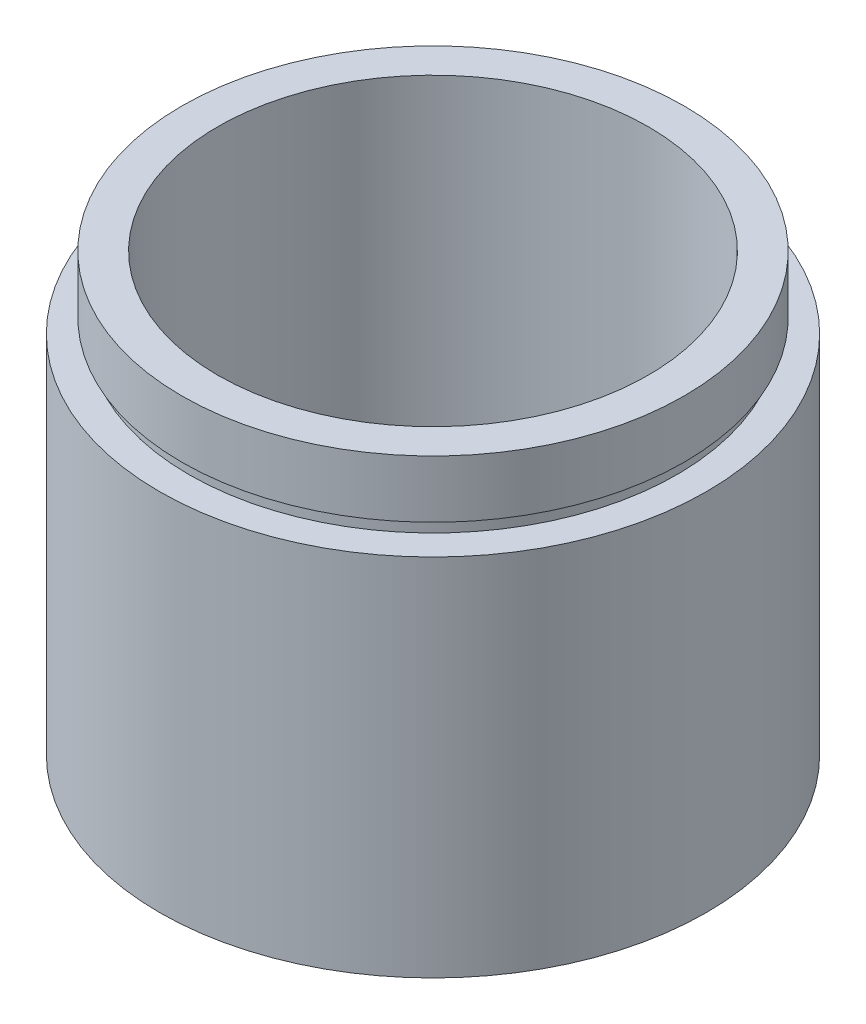
ISO-10303-21;
HEADER;
FILE_DESCRIPTION(('STEP AP214'),'2;1');
FILE_NAME('part.step','',(''),(''),'','','');
FILE_SCHEMA(('AUTOMOTIVE_DESIGN { 1 0 10303 214 1 1 1 1 }'));
ENDSEC;
DATA;
#1=APPLICATION_CONTEXT('core data for automotive mechanical design processes');
#2=APPLICATION_PROTOCOL_DEFINITION('international standard','automotive_design',2000,#1);
#3=PRODUCT_CONTEXT('',#1,'mechanical');
#4=PRODUCT('Part','Part','',(#3));
#5=PRODUCT_RELATED_PRODUCT_CATEGORY('part','',(#4));
#6=PRODUCT_DEFINITION_FORMATION('','',#4);
#7=PRODUCT_DEFINITION_CONTEXT('part definition',#1,'design');
#8=PRODUCT_DEFINITION('design','',#6,#7);
#9=PRODUCT_DEFINITION_SHAPE('','',#8);
#10=(LENGTH_UNIT() NAMED_UNIT(*) SI_UNIT(.MILLI.,.METRE.));
#11=(NAMED_UNIT(*) PLANE_ANGLE_UNIT() SI_UNIT($,.RADIAN.));
#12=(NAMED_UNIT(*) SI_UNIT($,.STERADIAN.) SOLID_ANGLE_UNIT());
#13=UNCERTAINTY_MEASURE_WITH_UNIT(LENGTH_MEASURE(1.E-05),#10,'distance_accuracy_value','');
#14=(GEOMETRIC_REPRESENTATION_CONTEXT(3) GLOBAL_UNCERTAINTY_ASSIGNED_CONTEXT((#13)) GLOBAL_UNIT_ASSIGNED_CONTEXT((#10,
#11,#12)) REPRESENTATION_CONTEXT('',''));
#15=CARTESIAN_POINT('',(0.,0.,0.));
#16=DIRECTION('',(0.,0.,1.));
#17=DIRECTION('',(1.,0.,0.));
#18=AXIS2_PLACEMENT_3D('',#15,#16,#17);
#19=CARTESIAN_POINT('',(17.,0.,0.));
#20=DIRECTION('',(0.,1.,0.));
#21=DIRECTION('',(0.,0.,1.));
#22=AXIS2_PLACEMENT_3D('',#19,#20,#21);
#23=PLANE('',#22);
#24=CARTESIAN_POINT('',(0.,0.,0.));
#25=DIRECTION('',(0.,1.,0.));
#26=DIRECTION('',(0.,0.,1.));
#27=AXIS2_PLACEMENT_3D('',#24,#25,#26);
#28=CIRCLE('',#27,19.05);
#29=CARTESIAN_POINT('',(0.,0.,19.05));
#30=VERTEX_POINT('',#29);
#31=EDGE_CURVE('E10',#30,#30,#28,.T.);
#32=ORIENTED_EDGE('',*,*,#31,.F.);
#33=EDGE_LOOP('',(#32));
#34=FACE_BOUND('',#33,.T.);
#35=CARTESIAN_POINT('',(0.,0.,0.));
#36=DIRECTION('',(0.,1.,0.));
#37=DIRECTION('',(0.,0.,1.));
#38=AXIS2_PLACEMENT_3D('',#35,#36,#37);
#39=CIRCLE('',#38,17.);
#40=CARTESIAN_POINT('',(0.,0.,17.));
#41=VERTEX_POINT('',#40);
#42=EDGE_CURVE('E77',#41,#41,#39,.T.);
#43=ORIENTED_EDGE('',*,*,#42,.T.);
#44=EDGE_LOOP('',(#43));
#45=FACE_BOUND('',#44,.T.);
#46=ADVANCED_FACE('F37',(#34,#45),#23,.F.);
#47=CARTESIAN_POINT('',(0.,161.376166943427,0.));
#48=DIRECTION('',(0.,1.,0.));
#49=DIRECTION('',(0.,0.,1.));
#50=AXIS2_PLACEMENT_3D('',#47,#48,#49);
#51=CYLINDRICAL_SURFACE('',#50,19.05);
#52=CARTESIAN_POINT('',(0.,25.4,0.));
#53=DIRECTION('',(0.,1.,0.));
#54=DIRECTION('',(0.,0.,1.));
#55=AXIS2_PLACEMENT_3D('',#52,#53,#54);
#56=CIRCLE('',#55,19.05);
#57=CARTESIAN_POINT('',(0.,25.4,19.05));
#58=VERTEX_POINT('',#57);
#59=EDGE_CURVE('E43',#58,#58,#56,.T.);
#60=ORIENTED_EDGE('',*,*,#59,.F.);
#61=EDGE_LOOP('',(#60));
#62=FACE_BOUND('',#61,.T.);
#63=ORIENTED_EDGE('',*,*,#31,.T.);
#64=EDGE_LOOP('',(#63));
#65=FACE_BOUND('',#64,.T.);
#66=ADVANCED_FACE('F138',(#62,#65),#51,.T.);
#67=CARTESIAN_POINT('',(19.05,25.4,0.));
#68=DIRECTION('',(0.,-1.,0.));
#69=DIRECTION('',(0.,0.,-1.));
#70=AXIS2_PLACEMENT_3D('',#67,#68,#69);
#71=PLANE('',#70);
#72=CARTESIAN_POINT('',(0.,25.4,0.));
#73=DIRECTION('',(0.,1.,0.));
#74=DIRECTION('',(0.,0.,1.));
#75=AXIS2_PLACEMENT_3D('',#72,#73,#74);
#76=CIRCLE('',#75,17.);
#77=CARTESIAN_POINT('',(0.,25.4,17.));
#78=VERTEX_POINT('',#77);
#79=EDGE_CURVE('E47',#78,#78,#76,.T.);
#80=ORIENTED_EDGE('',*,*,#79,.F.);
#81=EDGE_LOOP('',(#80));
#82=FACE_BOUND('',#81,.T.);
#83=ORIENTED_EDGE('',*,*,#59,.T.);
#84=EDGE_LOOP('',(#83));
#85=FACE_BOUND('',#84,.T.);
#86=ADVANCED_FACE('F133',(#82,#85),#71,.F.);
#87=CARTESIAN_POINT('',(0.,161.376166943427,0.));
#88=DIRECTION('',(0.,1.,0.));
#89=DIRECTION('',(0.,0.,1.));
#90=AXIS2_PLACEMENT_3D('',#87,#88,#89);
#91=CYLINDRICAL_SURFACE('',#90,17.);
#92=CARTESIAN_POINT('',(0.,26.4,0.));
#93=DIRECTION('',(0.,1.,0.));
#94=DIRECTION('',(0.,0.,1.));
#95=AXIS2_PLACEMENT_3D('',#92,#93,#94);
#96=CIRCLE('',#95,17.);
#97=CARTESIAN_POINT('',(0.,26.4,17.));
#98=VERTEX_POINT('',#97);
#99=EDGE_CURVE('E51',#98,#98,#96,.T.);
#100=ORIENTED_EDGE('',*,*,#99,.F.);
#101=EDGE_LOOP('',(#100));
#102=FACE_BOUND('',#101,.T.);
#103=ORIENTED_EDGE('',*,*,#79,.T.);
#104=EDGE_LOOP('',(#103));
#105=FACE_BOUND('',#104,.T.);
#106=ADVANCED_FACE('F127',(#102,#105),#91,.T.);
#107=CARTESIAN_POINT('',(17.,26.4,0.));
#108=DIRECTION('',(0.,1.,0.));
#109=DIRECTION('',(0.,0.,1.));
#110=AXIS2_PLACEMENT_3D('',#107,#108,#109);
#111=PLANE('',#110);
#112=CARTESIAN_POINT('',(0.,26.4,0.));
#113=DIRECTION('',(0.,1.,0.));
#114=DIRECTION('',(0.,0.,1.));
#115=AXIS2_PLACEMENT_3D('',#112,#113,#114);
#116=CIRCLE('',#115,17.5);
#117=CARTESIAN_POINT('',(0.,26.4,17.5));
#118=VERTEX_POINT('',#117);
#119=EDGE_CURVE('E56',#118,#118,#116,.T.);
#120=ORIENTED_EDGE('',*,*,#119,.F.);
#121=EDGE_LOOP('',(#120));
#122=FACE_BOUND('',#121,.T.);
#123=ORIENTED_EDGE('',*,*,#99,.T.);
#124=EDGE_LOOP('',(#123));
#125=FACE_BOUND('',#124,.T.);
#126=ADVANCED_FACE('F121',(#122,#125),#111,.F.);
#127=CARTESIAN_POINT('',(0.,161.376166943427,0.));
#128=DIRECTION('',(0.,1.,0.));
#129=DIRECTION('',(0.,0.,1.));
#130=AXIS2_PLACEMENT_3D('',#127,#128,#129);
#131=CYLINDRICAL_SURFACE('',#130,17.5);
#132=CARTESIAN_POINT('',(0.,30.4,0.));
#133=DIRECTION('',(0.,1.,0.));
#134=DIRECTION('',(0.,0.,1.));
#135=AXIS2_PLACEMENT_3D('',#132,#133,#134);
#136=CIRCLE('',#135,17.5);
#137=CARTESIAN_POINT('',(0.,30.4,17.5));
#138=VERTEX_POINT('',#137);
#139=EDGE_CURVE('E59',#138,#138,#136,.T.);
#140=ORIENTED_EDGE('',*,*,#139,.F.);
#141=EDGE_LOOP('',(#140));
#142=FACE_BOUND('',#141,.T.);
#143=ORIENTED_EDGE('',*,*,#119,.T.);
#144=EDGE_LOOP('',(#143));
#145=FACE_BOUND('',#144,.T.);
#146=ADVANCED_FACE('F115',(#142,#145),#131,.T.);
#147=CARTESIAN_POINT('',(17.5,30.4,0.));
#148=DIRECTION('',(0.,-1.,0.));
#149=DIRECTION('',(0.,0.,-1.));
#150=AXIS2_PLACEMENT_3D('',#147,#148,#149);
#151=PLANE('',#150);
#152=CARTESIAN_POINT('',(0.,30.4,0.));
#153=DIRECTION('',(0.,1.,0.));
#154=DIRECTION('',(0.,0.,1.));
#155=AXIS2_PLACEMENT_3D('',#152,#153,#154);
#156=CIRCLE('',#155,15.);
#157=CARTESIAN_POINT('',(0.,30.4,15.));
#158=VERTEX_POINT('',#157);
#159=EDGE_CURVE('E62',#158,#158,#156,.T.);
#160=ORIENTED_EDGE('',*,*,#159,.F.);
#161=EDGE_LOOP('',(#160));
#162=FACE_BOUND('',#161,.T.);
#163=ORIENTED_EDGE('',*,*,#139,.T.);
#164=EDGE_LOOP('',(#163));
#165=FACE_BOUND('',#164,.T.);
#166=ADVANCED_FACE('F109',(#162,#165),#151,.F.);
#167=CARTESIAN_POINT('',(0.,161.376166943427,0.));
#168=DIRECTION('',(0.,1.,0.));
#169=DIRECTION('',(0.,0.,1.));
#170=AXIS2_PLACEMENT_3D('',#167,#168,#169);
#171=CYLINDRICAL_SURFACE('',#170,15.);
#172=CARTESIAN_POINT('',(0.,5.49999999999998,0.));
#173=DIRECTION('',(0.,1.,0.));
#174=DIRECTION('',(0.,0.,1.));
#175=AXIS2_PLACEMENT_3D('',#172,#173,#174);
#176=CIRCLE('',#175,15.);
#177=CARTESIAN_POINT('',(0.,5.49999999999998,15.));
#178=VERTEX_POINT('',#177);
#179=EDGE_CURVE('E65',#178,#178,#176,.T.);
#180=ORIENTED_EDGE('',*,*,#179,.F.);
#181=EDGE_LOOP('',(#180));
#182=FACE_BOUND('',#181,.T.);
#183=ORIENTED_EDGE('',*,*,#159,.T.);
#184=EDGE_LOOP('',(#183));
#185=FACE_BOUND('',#184,.T.);
#186=ADVANCED_FACE('F103',(#182,#185),#171,.F.);
#187=CARTESIAN_POINT('',(17.6,5.49999999999998,0.));
#188=DIRECTION('',(0.,1.,0.));
#189=DIRECTION('',(0.,0.,1.));
#190=AXIS2_PLACEMENT_3D('',#187,#188,#189);
#191=PLANE('',#190);
#192=CARTESIAN_POINT('',(0.,5.49999999999998,0.));
#193=DIRECTION('',(0.,1.,0.));
#194=DIRECTION('',(0.,0.,1.));
#195=AXIS2_PLACEMENT_3D('',#192,#193,#194);
#196=CIRCLE('',#195,17.6);
#197=CARTESIAN_POINT('',(0.,5.49999999999998,17.6));
#198=VERTEX_POINT('',#197);
#199=EDGE_CURVE('E68',#198,#198,#196,.T.);
#200=ORIENTED_EDGE('',*,*,#199,.F.);
#201=EDGE_LOOP('',(#200));
#202=FACE_BOUND('',#201,.T.);
#203=ORIENTED_EDGE('',*,*,#179,.T.);
#204=EDGE_LOOP('',(#203));
#205=FACE_BOUND('',#204,.T.);
#206=ADVANCED_FACE('F97',(#202,#205),#191,.F.);
#207=CARTESIAN_POINT('',(0.,161.376166943427,0.));
#208=DIRECTION('',(0.,1.,0.));
#209=DIRECTION('',(0.,0.,1.));
#210=AXIS2_PLACEMENT_3D('',#207,#208,#209);
#211=CYLINDRICAL_SURFACE('',#210,17.6);
#212=CARTESIAN_POINT('',(0.,4.49999999999998,0.));
#213=DIRECTION('',(0.,1.,0.));
#214=DIRECTION('',(0.,0.,1.));
#215=AXIS2_PLACEMENT_3D('',#212,#213,#214);
#216=CIRCLE('',#215,17.6);
#217=CARTESIAN_POINT('',(0.,4.49999999999998,17.6));
#218=VERTEX_POINT('',#217);
#219=EDGE_CURVE('E71',#218,#218,#216,.T.);
#220=ORIENTED_EDGE('',*,*,#219,.F.);
#221=EDGE_LOOP('',(#220));
#222=FACE_BOUND('',#221,.T.);
#223=ORIENTED_EDGE('',*,*,#199,.T.);
#224=EDGE_LOOP('',(#223));
#225=FACE_BOUND('',#224,.T.);
#226=ADVANCED_FACE('F91',(#222,#225),#211,.F.);
#227=CARTESIAN_POINT('',(17.,4.49999999999998,0.));
#228=DIRECTION('',(0.,-1.,0.));
#229=DIRECTION('',(0.,0.,-1.));
#230=AXIS2_PLACEMENT_3D('',#227,#228,#229);
#231=PLANE('',#230);
#232=CARTESIAN_POINT('',(0.,4.49999999999998,0.));
#233=DIRECTION('',(0.,1.,0.));
#234=DIRECTION('',(0.,0.,1.));
#235=AXIS2_PLACEMENT_3D('',#232,#233,#234);
#236=CIRCLE('',#235,17.);
#237=CARTESIAN_POINT('',(0.,4.49999999999998,17.));
#238=VERTEX_POINT('',#237);
#239=EDGE_CURVE('E74',#238,#238,#236,.T.);
#240=ORIENTED_EDGE('',*,*,#239,.F.);
#241=EDGE_LOOP('',(#240));
#242=FACE_BOUND('',#241,.T.);
#243=ORIENTED_EDGE('',*,*,#219,.T.);
#244=EDGE_LOOP('',(#243));
#245=FACE_BOUND('',#244,.T.);
#246=ADVANCED_FACE('F85',(#242,#245),#231,.F.);
#247=CARTESIAN_POINT('',(0.,161.376166943427,0.));
#248=DIRECTION('',(0.,1.,0.));
#249=DIRECTION('',(0.,0.,1.));
#250=AXIS2_PLACEMENT_3D('',#247,#248,#249);
#251=CYLINDRICAL_SURFACE('',#250,17.);
#252=ORIENTED_EDGE('',*,*,#42,.F.);
#253=EDGE_LOOP('',(#252));
#254=FACE_BOUND('',#253,.T.);
#255=ORIENTED_EDGE('',*,*,#239,.T.);
#256=EDGE_LOOP('',(#255));
#257=FACE_BOUND('',#256,.T.);
#258=ADVANCED_FACE('F82',(#254,#257),#251,.F.);
#259=CLOSED_SHELL('',(#46,#66,#86,#106,#126,#146,#166,#186,#206,#226,#246,#258));
#260=MANIFOLD_SOLID_BREP('B2',#259);
#261=ADVANCED_BREP_SHAPE_REPRESENTATION('',(#18,#260),#14);
#262=SHAPE_DEFINITION_REPRESENTATION(#9,#261);
ENDSEC;
END-ISO-10303-21;
